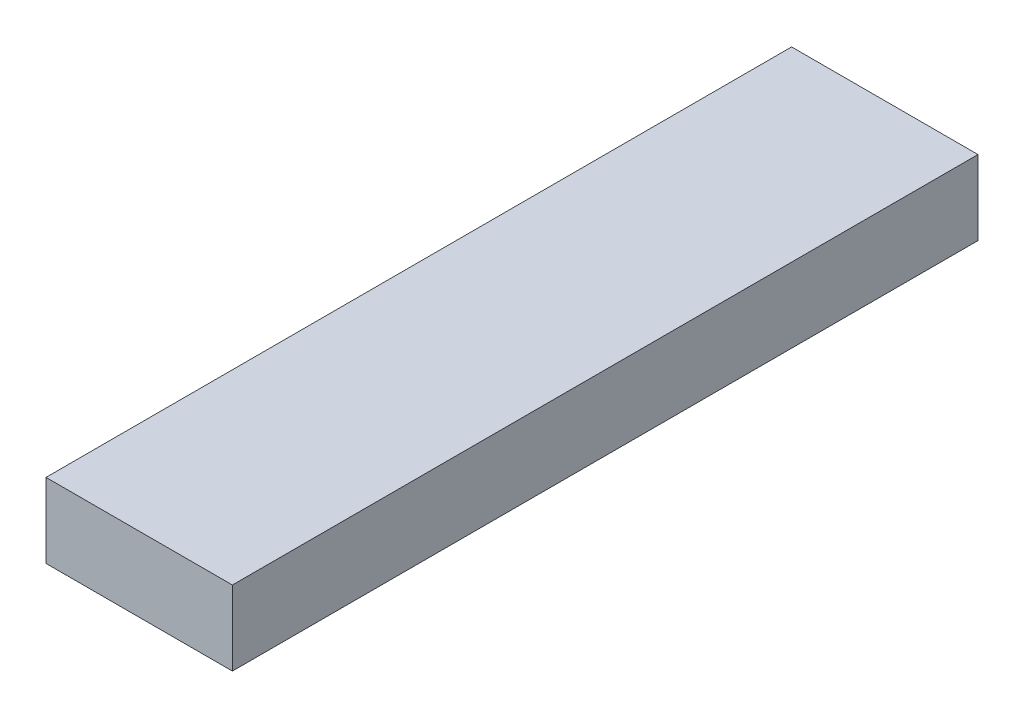
ISO-10303-21;
HEADER;
FILE_DESCRIPTION(('STEP AP214'),'2;1');
FILE_NAME('part.step','',(''),(''),'','','');
FILE_SCHEMA(('AUTOMOTIVE_DESIGN { 1 0 10303 214 1 1 1 1 }'));
ENDSEC;
DATA;
#1=APPLICATION_CONTEXT('core data for automotive mechanical design processes');
#2=APPLICATION_PROTOCOL_DEFINITION('international standard','automotive_design',2000,#1);
#3=PRODUCT_CONTEXT('',#1,'mechanical');
#4=PRODUCT('Part','Part','',(#3));
#5=PRODUCT_RELATED_PRODUCT_CATEGORY('part','',(#4));
#6=PRODUCT_DEFINITION_FORMATION('','',#4);
#7=PRODUCT_DEFINITION_CONTEXT('part definition',#1,'design');
#8=PRODUCT_DEFINITION('design','',#6,#7);
#9=PRODUCT_DEFINITION_SHAPE('','',#8);
#10=(LENGTH_UNIT() NAMED_UNIT(*) SI_UNIT(.MILLI.,.METRE.));
#11=(NAMED_UNIT(*) PLANE_ANGLE_UNIT() SI_UNIT($,.RADIAN.));
#12=(NAMED_UNIT(*) SI_UNIT($,.STERADIAN.) SOLID_ANGLE_UNIT());
#13=UNCERTAINTY_MEASURE_WITH_UNIT(LENGTH_MEASURE(1.E-05),#10,'distance_accuracy_value','');
#14=(GEOMETRIC_REPRESENTATION_CONTEXT(3) GLOBAL_UNCERTAINTY_ASSIGNED_CONTEXT((#13)) GLOBAL_UNIT_ASSIGNED_CONTEXT((#10,
#11,#12)) REPRESENTATION_CONTEXT('',''));
#15=CARTESIAN_POINT('',(0.,0.,0.));
#16=DIRECTION('',(0.,0.,1.));
#17=DIRECTION('',(1.,0.,0.));
#18=AXIS2_PLACEMENT_3D('',#15,#16,#17);
#19=CARTESIAN_POINT('',(0.,0.,2.));
#20=DIRECTION('',(1.,0.,0.));
#21=DIRECTION('',(0.,0.,-1.));
#22=AXIS2_PLACEMENT_3D('',#19,#20,#21);
#23=PLANE('',#22);
#24=DIRECTION('',(0.,-1.,0.));
#25=VECTOR('',#24,1.);
#26=CARTESIAN_POINT('',(0.,0.,0.));
#27=LINE('',#26,#25);
#28=CARTESIAN_POINT('',(0.,0.200000000000001,0.));
#29=VERTEX_POINT('',#28);
#30=CARTESIAN_POINT('',(0.,0.,0.));
#31=VERTEX_POINT('',#30);
#32=EDGE_CURVE('E101',#29,#31,#27,.T.);
#33=ORIENTED_EDGE('',*,*,#32,.T.);
#34=DIRECTION('',(0.,0.,-1.));
#35=VECTOR('',#34,1.);
#36=CARTESIAN_POINT('',(0.,0.,2.));
#37=LINE('',#36,#35);
#38=CARTESIAN_POINT('',(0.,0.,2.));
#39=VERTEX_POINT('',#38);
#40=EDGE_CURVE('E11',#39,#31,#37,.T.);
#41=ORIENTED_EDGE('',*,*,#40,.F.);
#42=DIRECTION('',(0.,-1.,0.));
#43=VECTOR('',#42,1.);
#44=CARTESIAN_POINT('',(0.,0.,2.));
#45=LINE('',#44,#43);
#46=CARTESIAN_POINT('',(0.,0.200000000000001,2.));
#47=VERTEX_POINT('',#46);
#48=EDGE_CURVE('E89',#47,#39,#45,.T.);
#49=ORIENTED_EDGE('',*,*,#48,.F.);
#50=DIRECTION('',(0.,0.,-1.));
#51=VECTOR('',#50,1.);
#52=CARTESIAN_POINT('',(0.,0.200000000000001,2.));
#53=LINE('',#52,#51);
#54=EDGE_CURVE('E97',#47,#29,#53,.T.);
#55=ORIENTED_EDGE('',*,*,#54,.T.);
#56=EDGE_LOOP('',(#33,#41,#49,#55));
#57=FACE_BOUND('',#56,.T.);
#58=ADVANCED_FACE('F38',(#57),#23,.F.);
#59=CARTESIAN_POINT('',(0.,0.,2.));
#60=DIRECTION('',(0.,1.,0.));
#61=DIRECTION('',(0.,0.,1.));
#62=AXIS2_PLACEMENT_3D('',#59,#60,#61);
#63=PLANE('',#62);
#64=DIRECTION('',(1.,0.,0.));
#65=VECTOR('',#64,1.);
#66=CARTESIAN_POINT('',(0.,0.,0.));
#67=LINE('',#66,#65);
#68=CARTESIAN_POINT('',(0.5,0.,0.));
#69=VERTEX_POINT('',#68);
#70=EDGE_CURVE('E93',#31,#69,#67,.T.);
#71=ORIENTED_EDGE('',*,*,#70,.T.);
#72=DIRECTION('',(0.,0.,-1.));
#73=VECTOR('',#72,1.);
#74=CARTESIAN_POINT('',(0.5,0.,2.));
#75=LINE('',#74,#73);
#76=CARTESIAN_POINT('',(0.5,0.,2.));
#77=VERTEX_POINT('',#76);
#78=EDGE_CURVE('E46',#77,#69,#75,.T.);
#79=ORIENTED_EDGE('',*,*,#78,.F.);
#80=DIRECTION('',(1.,0.,0.));
#81=VECTOR('',#80,1.);
#82=CARTESIAN_POINT('',(0.,0.,2.));
#83=LINE('',#82,#81);
#84=EDGE_CURVE('E84',#39,#77,#83,.T.);
#85=ORIENTED_EDGE('',*,*,#84,.F.);
#86=ORIENTED_EDGE('',*,*,#40,.T.);
#87=EDGE_LOOP('',(#71,#79,#85,#86));
#88=FACE_BOUND('',#87,.T.);
#89=ADVANCED_FACE('F92',(#88),#63,.F.);
#90=CARTESIAN_POINT('',(0.5,0.,2.));
#91=DIRECTION('',(-1.,0.,0.));
#92=DIRECTION('',(0.,0.,1.));
#93=AXIS2_PLACEMENT_3D('',#90,#91,#92);
#94=PLANE('',#93);
#95=DIRECTION('',(0.,1.,0.));
#96=VECTOR('',#95,1.);
#97=CARTESIAN_POINT('',(0.5,0.,0.));
#98=LINE('',#97,#96);
#99=CARTESIAN_POINT('',(0.5,0.2,0.));
#100=VERTEX_POINT('',#99);
#101=EDGE_CURVE('E71',#69,#100,#98,.T.);
#102=ORIENTED_EDGE('',*,*,#101,.T.);
#103=DIRECTION('',(0.,0.,-1.));
#104=VECTOR('',#103,1.);
#105=CARTESIAN_POINT('',(0.5,0.2,2.));
#106=LINE('',#105,#104);
#107=CARTESIAN_POINT('',(0.5,0.2,2.));
#108=VERTEX_POINT('',#107);
#109=EDGE_CURVE('E94',#108,#100,#106,.T.);
#110=ORIENTED_EDGE('',*,*,#109,.F.);
#111=DIRECTION('',(0.,1.,0.));
#112=VECTOR('',#111,1.);
#113=CARTESIAN_POINT('',(0.5,0.,2.));
#114=LINE('',#113,#112);
#115=EDGE_CURVE('E87',#77,#108,#114,.T.);
#116=ORIENTED_EDGE('',*,*,#115,.F.);
#117=ORIENTED_EDGE('',*,*,#78,.T.);
#118=EDGE_LOOP('',(#102,#110,#116,#117));
#119=FACE_BOUND('',#118,.T.);
#120=ADVANCED_FACE('F95',(#119),#94,.F.);
#121=CARTESIAN_POINT('',(0.,0.200000000000001,2.));
#122=DIRECTION('',(0.,-1.,0.));
#123=DIRECTION('',(1.,0.,0.));
#124=AXIS2_PLACEMENT_3D('',#121,#122,#123);
#125=PLANE('',#124);
#126=DIRECTION('',(-1.,0.,0.));
#127=VECTOR('',#126,1.);
#128=CARTESIAN_POINT('',(0.,0.200000000000001,0.));
#129=LINE('',#128,#127);
#130=EDGE_CURVE('E77',#100,#29,#129,.T.);
#131=ORIENTED_EDGE('',*,*,#130,.T.);
#132=ORIENTED_EDGE('',*,*,#54,.F.);
#133=DIRECTION('',(-1.,0.,0.));
#134=VECTOR('',#133,1.);
#135=CARTESIAN_POINT('',(0.,0.200000000000001,2.));
#136=LINE('',#135,#134);
#137=EDGE_CURVE('E54',#108,#47,#136,.T.);
#138=ORIENTED_EDGE('',*,*,#137,.F.);
#139=ORIENTED_EDGE('',*,*,#109,.T.);
#140=EDGE_LOOP('',(#131,#132,#138,#139));
#141=FACE_BOUND('',#140,.T.);
#142=ADVANCED_FACE('F108',(#141),#125,.F.);
#143=CARTESIAN_POINT('',(0.,0.200000000000001,2.));
#144=DIRECTION('',(0.,0.,-1.));
#145=DIRECTION('',(-1.,0.,0.));
#146=AXIS2_PLACEMENT_3D('',#143,#144,#145);
#147=PLANE('',#146);
#148=ORIENTED_EDGE('',*,*,#48,.T.);
#149=ORIENTED_EDGE('',*,*,#84,.T.);
#150=ORIENTED_EDGE('',*,*,#115,.T.);
#151=ORIENTED_EDGE('',*,*,#137,.T.);
#152=EDGE_LOOP('',(#148,#149,#150,#151));
#153=FACE_BOUND('',#152,.T.);
#154=ADVANCED_FACE('F85',(#153),#147,.F.);
#155=CARTESIAN_POINT('',(0.,0.200000000000001,0.));
#156=DIRECTION('',(0.,0.,-1.));
#157=DIRECTION('',(-1.,0.,0.));
#158=AXIS2_PLACEMENT_3D('',#155,#156,#157);
#159=PLANE('',#158);
#160=ORIENTED_EDGE('',*,*,#32,.F.);
#161=ORIENTED_EDGE('',*,*,#130,.F.);
#162=ORIENTED_EDGE('',*,*,#101,.F.);
#163=ORIENTED_EDGE('',*,*,#70,.F.);
#164=EDGE_LOOP('',(#160,#161,#162,#163));
#165=FACE_BOUND('',#164,.T.);
#166=ADVANCED_FACE('F111',(#165),#159,.T.);
#167=CLOSED_SHELL('',(#58,#89,#120,#142,#154,#166));
#168=MANIFOLD_SOLID_BREP('B2',#167);
#169=ADVANCED_BREP_SHAPE_REPRESENTATION('',(#18,#168),#14);
#170=SHAPE_DEFINITION_REPRESENTATION(#9,#169);
ENDSEC;
END-ISO-10303-21;
